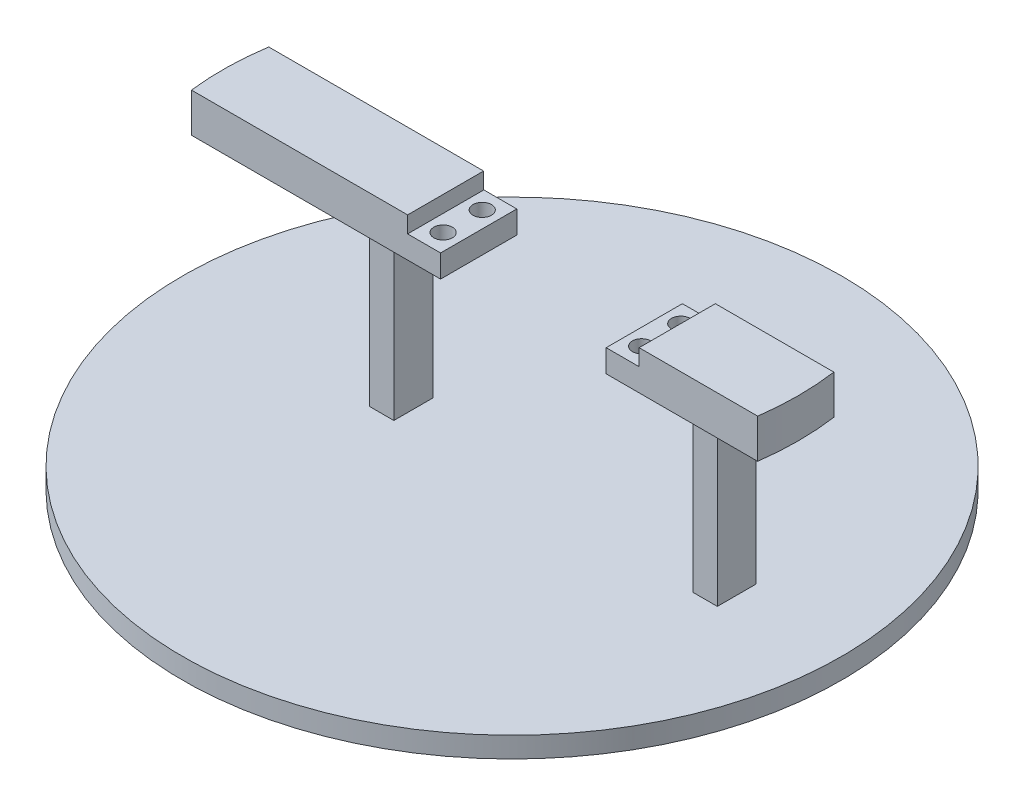
ISO-10303-21;
HEADER;
FILE_DESCRIPTION(('STEP AP214'),'2;1');
FILE_NAME('part.step','',(''),(''),'','','');
FILE_SCHEMA(('AUTOMOTIVE_DESIGN { 1 0 10303 214 1 1 1 1 }'));
ENDSEC;
DATA;
#1=APPLICATION_CONTEXT('core data for automotive mechanical design processes');
#2=APPLICATION_PROTOCOL_DEFINITION('international standard','automotive_design',2000,#1);
#3=PRODUCT_CONTEXT('',#1,'mechanical');
#4=PRODUCT('Part','Part','',(#3));
#5=PRODUCT_RELATED_PRODUCT_CATEGORY('part','',(#4));
#6=PRODUCT_DEFINITION_FORMATION('','',#4);
#7=PRODUCT_DEFINITION_CONTEXT('part definition',#1,'design');
#8=PRODUCT_DEFINITION('design','',#6,#7);
#9=PRODUCT_DEFINITION_SHAPE('','',#8);
#10=(LENGTH_UNIT() NAMED_UNIT(*) SI_UNIT(.MILLI.,.METRE.));
#11=(NAMED_UNIT(*) PLANE_ANGLE_UNIT() SI_UNIT($,.RADIAN.));
#12=(NAMED_UNIT(*) SI_UNIT($,.STERADIAN.) SOLID_ANGLE_UNIT());
#13=UNCERTAINTY_MEASURE_WITH_UNIT(LENGTH_MEASURE(1.E-05),#10,'distance_accuracy_value','');
#14=(GEOMETRIC_REPRESENTATION_CONTEXT(3) GLOBAL_UNCERTAINTY_ASSIGNED_CONTEXT((#13)) GLOBAL_UNIT_ASSIGNED_CONTEXT((#10,
#11,#12)) REPRESENTATION_CONTEXT('',''));
#15=CARTESIAN_POINT('',(0.,0.,0.));
#16=DIRECTION('',(0.,0.,1.));
#17=DIRECTION('',(1.,0.,0.));
#18=AXIS2_PLACEMENT_3D('',#15,#16,#17);
#19=CARTESIAN_POINT('',(-29.9126923195834,9.5,-4.65632595381181));
#20=DIRECTION('',(-1.,0.,0.));
#21=DIRECTION('',(0.,0.,1.));
#22=AXIS2_PLACEMENT_3D('',#19,#20,#21);
#23=PLANE('',#22);
#24=DIRECTION('',(0.,-1.,0.));
#25=VECTOR('',#24,1.);
#26=CARTESIAN_POINT('',(-29.9126923195834,9.5,-14.1563259538118));
#27=LINE('',#26,#25);
#28=CARTESIAN_POINT('',(-29.9126923195834,0.,-14.1563259538118));
#29=VERTEX_POINT('',#28);
#30=CARTESIAN_POINT('',(-29.9126923195834,-40.,-14.1563259538118));
#31=VERTEX_POINT('',#30);
#32=EDGE_CURVE('E287',#29,#31,#27,.T.);
#33=ORIENTED_EDGE('',*,*,#32,.T.);
#34=DIRECTION('',(0.,0.,1.));
#35=VECTOR('',#34,1.);
#36=CARTESIAN_POINT('',(-29.9126923195834,-40.,-4.65632595381181));
#37=LINE('',#36,#35);
#38=CARTESIAN_POINT('',(-29.9126923195834,-40.,-4.65632595381181));
#39=VERTEX_POINT('',#38);
#40=EDGE_CURVE('E58',#31,#39,#37,.T.);
#41=ORIENTED_EDGE('',*,*,#40,.T.);
#42=DIRECTION('',(0.,-1.,0.));
#43=VECTOR('',#42,1.);
#44=CARTESIAN_POINT('',(-29.9126923195834,9.5,-4.65632595381181));
#45=LINE('',#44,#43);
#46=CARTESIAN_POINT('',(-29.9126923195834,0.,-4.65632595381181));
#47=VERTEX_POINT('',#46);
#48=EDGE_CURVE('E288',#47,#39,#45,.T.);
#49=ORIENTED_EDGE('',*,*,#48,.F.);
#50=DIRECTION('',(0.,0.,-1.));
#51=VECTOR('',#50,1.);
#52=CARTESIAN_POINT('',(-29.9126923195834,0.,0.));
#53=LINE('',#52,#51);
#54=EDGE_CURVE('E316',#47,#29,#53,.T.);
#55=ORIENTED_EDGE('',*,*,#54,.T.);
#56=EDGE_LOOP('',(#33,#41,#49,#55));
#57=FACE_BOUND('',#56,.T.);
#58=ADVANCED_FACE('F35',(#57),#23,.T.);
#59=CARTESIAN_POINT('',(-29.9126923195834,9.5,-4.65632595381181));
#60=DIRECTION('',(0.,0.,-1.));
#61=DIRECTION('',(-1.,0.,0.));
#62=AXIS2_PLACEMENT_3D('',#59,#60,#61);
#63=PLANE('',#62);
#64=DIRECTION('',(-1.,0.,0.));
#65=VECTOR('',#64,1.);
#66=CARTESIAN_POINT('',(-29.9126923195834,-40.,-4.65632595381181));
#67=LINE('',#66,#65);
#68=CARTESIAN_POINT('',(-23.9626923195834,-40.,-4.65632595381181));
#69=VERTEX_POINT('',#68);
#70=EDGE_CURVE('E284',#69,#39,#67,.T.);
#71=ORIENTED_EDGE('',*,*,#70,.F.);
#72=DIRECTION('',(0.,-1.,0.));
#73=VECTOR('',#72,1.);
#74=CARTESIAN_POINT('',(-23.9626923195834,9.5,-4.65632595381181));
#75=LINE('',#74,#73);
#76=CARTESIAN_POINT('',(-23.9626923195834,0.,-4.65632595381181));
#77=VERTEX_POINT('',#76);
#78=EDGE_CURVE('E292',#77,#69,#75,.T.);
#79=ORIENTED_EDGE('',*,*,#78,.F.);
#80=DIRECTION('',(1.,0.,0.));
#81=VECTOR('',#80,1.);
#82=CARTESIAN_POINT('',(0.,0.,-4.65632595381181));
#83=LINE('',#82,#81);
#84=EDGE_CURVE('E314',#47,#77,#83,.T.);
#85=ORIENTED_EDGE('',*,*,#84,.F.);
#86=ORIENTED_EDGE('',*,*,#48,.T.);
#87=EDGE_LOOP('',(#71,#79,#85,#86));
#88=FACE_BOUND('',#87,.T.);
#89=ADVANCED_FACE('F426',(#88),#63,.F.);
#90=CARTESIAN_POINT('',(-23.9626923195834,9.5,-4.65632595381181));
#91=DIRECTION('',(-1.,0.,0.));
#92=DIRECTION('',(0.,0.,1.));
#93=AXIS2_PLACEMENT_3D('',#90,#91,#92);
#94=PLANE('',#93);
#95=DIRECTION('',(0.,0.,1.));
#96=VECTOR('',#95,1.);
#97=CARTESIAN_POINT('',(-23.9626923195834,-40.,-4.65632595381181));
#98=LINE('',#97,#96);
#99=CARTESIAN_POINT('',(-23.9626923195834,-40.,-14.1563259538118));
#100=VERTEX_POINT('',#99);
#101=EDGE_CURVE('E280',#100,#69,#98,.T.);
#102=ORIENTED_EDGE('',*,*,#101,.F.);
#103=DIRECTION('',(0.,-1.,0.));
#104=VECTOR('',#103,1.);
#105=CARTESIAN_POINT('',(-23.9626923195834,9.5,-14.1563259538118));
#106=LINE('',#105,#104);
#107=CARTESIAN_POINT('',(-23.9626923195834,0.,-14.1563259538118));
#108=VERTEX_POINT('',#107);
#109=EDGE_CURVE('E295',#108,#100,#106,.T.);
#110=ORIENTED_EDGE('',*,*,#109,.F.);
#111=DIRECTION('',(0.,0.,-1.));
#112=VECTOR('',#111,1.);
#113=CARTESIAN_POINT('',(-23.9626923195834,0.,0.));
#114=LINE('',#113,#112);
#115=EDGE_CURVE('E291',#77,#108,#114,.T.);
#116=ORIENTED_EDGE('',*,*,#115,.F.);
#117=ORIENTED_EDGE('',*,*,#78,.T.);
#118=EDGE_LOOP('',(#102,#110,#116,#117));
#119=FACE_BOUND('',#118,.T.);
#120=ADVANCED_FACE('F421',(#119),#94,.F.);
#121=CARTESIAN_POINT('',(-29.9126923195834,9.5,-14.1563259538118));
#122=DIRECTION('',(0.,0.,-1.));
#123=DIRECTION('',(-1.,0.,0.));
#124=AXIS2_PLACEMENT_3D('',#121,#122,#123);
#125=PLANE('',#124);
#126=ORIENTED_EDGE('',*,*,#109,.T.);
#127=DIRECTION('',(-1.,0.,0.));
#128=VECTOR('',#127,1.);
#129=CARTESIAN_POINT('',(-29.9126923195834,-40.,-14.1563259538118));
#130=LINE('',#129,#128);
#131=EDGE_CURVE('E11',#100,#31,#130,.T.);
#132=ORIENTED_EDGE('',*,*,#131,.T.);
#133=ORIENTED_EDGE('',*,*,#32,.F.);
#134=DIRECTION('',(1.,0.,0.));
#135=VECTOR('',#134,1.);
#136=CARTESIAN_POINT('',(0.,0.,-14.1563259538118));
#137=LINE('',#136,#135);
#138=EDGE_CURVE('E319',#29,#108,#137,.T.);
#139=ORIENTED_EDGE('',*,*,#138,.T.);
#140=EDGE_LOOP('',(#126,#132,#133,#139));
#141=FACE_BOUND('',#140,.T.);
#142=ADVANCED_FACE('F415',(#141),#125,.T.);
#143=CARTESIAN_POINT('',(-16.0156772185343,5.5,0.));
#144=DIRECTION('',(1.,0.,0.));
#145=DIRECTION('',(0.,0.,-1.));
#146=AXIS2_PLACEMENT_3D('',#143,#144,#145);
#147=PLANE('',#146);
#148=DIRECTION('',(0.,-1.,0.));
#149=VECTOR('',#148,1.);
#150=CARTESIAN_POINT('',(-16.0156772185343,9.5,-18.5));
#151=LINE('',#150,#149);
#152=CARTESIAN_POINT('',(-16.0156772185343,5.5,-18.5));
#153=VERTEX_POINT('',#152);
#154=CARTESIAN_POINT('',(-16.0156772185343,0.,-18.5));
#155=VERTEX_POINT('',#154);
#156=EDGE_CURVE('E43',#153,#155,#151,.T.);
#157=ORIENTED_EDGE('',*,*,#156,.F.);
#158=DIRECTION('',(0.,0.,1.));
#159=VECTOR('',#158,1.);
#160=CARTESIAN_POINT('',(-16.0156772185343,5.5,0.));
#161=LINE('',#160,#159);
#162=CARTESIAN_POINT('',(-16.0156772185343,5.5,-18.5547471156606));
#163=VERTEX_POINT('',#162);
#164=EDGE_CURVE('E346',#163,#153,#161,.T.);
#165=ORIENTED_EDGE('',*,*,#164,.F.);
#166=DIRECTION('',(0.,-1.,0.));
#167=VECTOR('',#166,1.);
#168=CARTESIAN_POINT('',(-16.0156772185343,5.5,-18.5547471156606));
#169=LINE('',#168,#167);
#170=CARTESIAN_POINT('',(-16.0156772185343,0.,-18.5547471156606));
#171=VERTEX_POINT('',#170);
#172=EDGE_CURVE('E374',#163,#171,#169,.T.);
#173=ORIENTED_EDGE('',*,*,#172,.T.);
#174=DIRECTION('',(0.,0.,1.));
#175=VECTOR('',#174,1.);
#176=CARTESIAN_POINT('',(-16.0156772185343,0.,0.));
#177=LINE('',#176,#175);
#178=EDGE_CURVE('E363',#171,#155,#177,.T.);
#179=ORIENTED_EDGE('',*,*,#178,.T.);
#180=EDGE_LOOP('',(#157,#165,#173,#179));
#181=FACE_BOUND('',#180,.T.);
#182=ADVANCED_FACE('F413',(#181),#147,.F.);
#183=CARTESIAN_POINT('',(-8.01567721853434,5.5,0.));
#184=DIRECTION('',(1.,0.,0.));
#185=DIRECTION('',(0.,0.,-1.));
#186=AXIS2_PLACEMENT_3D('',#183,#184,#185);
#187=PLANE('',#186);
#188=DIRECTION('',(0.,0.,1.));
#189=VECTOR('',#188,1.);
#190=CARTESIAN_POINT('',(-8.01567721853434,0.,0.));
#191=LINE('',#190,#189);
#192=CARTESIAN_POINT('',(-8.01567721853434,0.,-18.5547471156606));
#193=VERTEX_POINT('',#192);
#194=CARTESIAN_POINT('',(-8.01567721853434,0.,-0.0547471156605653));
#195=VERTEX_POINT('',#194);
#196=EDGE_CURVE('E337',#193,#195,#191,.T.);
#197=ORIENTED_EDGE('',*,*,#196,.F.);
#198=DIRECTION('',(0.,-1.,0.));
#199=VECTOR('',#198,1.);
#200=CARTESIAN_POINT('',(-8.01567721853434,5.5,-18.5547471156606));
#201=LINE('',#200,#199);
#202=CARTESIAN_POINT('',(-8.01567721853434,5.5,-18.5547471156606));
#203=VERTEX_POINT('',#202);
#204=EDGE_CURVE('E375',#203,#193,#201,.T.);
#205=ORIENTED_EDGE('',*,*,#204,.F.);
#206=DIRECTION('',(0.,0.,1.));
#207=VECTOR('',#206,1.);
#208=CARTESIAN_POINT('',(-8.01567721853434,5.5,0.));
#209=LINE('',#208,#207);
#210=CARTESIAN_POINT('',(-8.01567721853434,5.5,-0.0547471156605653));
#211=VERTEX_POINT('',#210);
#212=EDGE_CURVE('E338',#203,#211,#209,.T.);
#213=ORIENTED_EDGE('',*,*,#212,.T.);
#214=DIRECTION('',(0.,-1.,0.));
#215=VECTOR('',#214,1.);
#216=CARTESIAN_POINT('',(-8.01567721853434,5.5,-0.0547471156605653));
#217=LINE('',#216,#215);
#218=EDGE_CURVE('E357',#211,#195,#217,.T.);
#219=ORIENTED_EDGE('',*,*,#218,.T.);
#220=EDGE_LOOP('',(#197,#205,#213,#219));
#221=FACE_BOUND('',#220,.T.);
#222=ADVANCED_FACE('F37',(#221),#187,.T.);
#223=CARTESIAN_POINT('',(0.,5.5,-18.5547471156606));
#224=DIRECTION('',(0.,0.,-1.));
#225=DIRECTION('',(-1.,0.,0.));
#226=AXIS2_PLACEMENT_3D('',#223,#224,#225);
#227=PLANE('',#226);
#228=DIRECTION('',(1.,0.,0.));
#229=VECTOR('',#228,1.);
#230=CARTESIAN_POINT('',(0.,0.,-18.5547471156606));
#231=LINE('',#230,#229);
#232=EDGE_CURVE('E360',#171,#193,#231,.T.);
#233=ORIENTED_EDGE('',*,*,#232,.F.);
#234=ORIENTED_EDGE('',*,*,#172,.F.);
#235=DIRECTION('',(1.,0.,0.));
#236=VECTOR('',#235,1.);
#237=CARTESIAN_POINT('',(0.,5.5,-18.5547471156606));
#238=LINE('',#237,#236);
#239=EDGE_CURVE('E341',#163,#203,#238,.T.);
#240=ORIENTED_EDGE('',*,*,#239,.T.);
#241=ORIENTED_EDGE('',*,*,#204,.T.);
#242=EDGE_LOOP('',(#233,#234,#240,#241));
#243=FACE_BOUND('',#242,.T.);
#244=ADVANCED_FACE('F412',(#243),#227,.T.);
#245=CARTESIAN_POINT('',(-12.0097074206325,5.5,-4.65632595381181));
#246=DIRECTION('',(0.,-1.,0.));
#247=DIRECTION('',(0.,0.,-1.));
#248=AXIS2_PLACEMENT_3D('',#245,#246,#247);
#249=CYLINDRICAL_SURFACE('',#248,2.25);
#250=CARTESIAN_POINT('',(-12.0097074206325,5.5,-4.65632595381181));
#251=DIRECTION('',(0.,1.,0.));
#252=DIRECTION('',(0.,0.,1.));
#253=AXIS2_PLACEMENT_3D('',#250,#251,#252);
#254=CIRCLE('',#253,2.25);
#255=CARTESIAN_POINT('',(-12.0097074206325,5.5,-2.40632595381181));
#256=VERTEX_POINT('',#255);
#257=EDGE_CURVE('E351',#256,#256,#254,.T.);
#258=ORIENTED_EDGE('',*,*,#257,.T.);
#259=EDGE_LOOP('',(#258));
#260=FACE_BOUND('',#259,.T.);
#261=CARTESIAN_POINT('',(-12.0097074206325,0.,-4.65632595381181));
#262=DIRECTION('',(0.,1.,0.));
#263=DIRECTION('',(0.,0.,1.));
#264=AXIS2_PLACEMENT_3D('',#261,#262,#263);
#265=CIRCLE('',#264,2.25);
#266=CARTESIAN_POINT('',(-12.0097074206325,0.,-2.40632595381181));
#267=VERTEX_POINT('',#266);
#268=EDGE_CURVE('E368',#267,#267,#265,.T.);
#269=ORIENTED_EDGE('',*,*,#268,.F.);
#270=EDGE_LOOP('',(#269));
#271=FACE_BOUND('',#270,.T.);
#272=ADVANCED_FACE('F453',(#260,#271),#249,.F.);
#273=CARTESIAN_POINT('',(0.,5.5,-0.0547471156605653));
#274=DIRECTION('',(0.,0.,-1.));
#275=DIRECTION('',(-1.,0.,0.));
#276=AXIS2_PLACEMENT_3D('',#273,#274,#275);
#277=PLANE('',#276);
#278=DIRECTION('',(1.,0.,0.));
#279=VECTOR('',#278,1.);
#280=CARTESIAN_POINT('',(0.,0.,-0.0547471156605653));
#281=LINE('',#280,#279);
#282=CARTESIAN_POINT('',(-68.4860401881046,0.,-0.0547471156605653));
#283=VERTEX_POINT('',#282);
#284=EDGE_CURVE('E365',#283,#195,#281,.T.);
#285=ORIENTED_EDGE('',*,*,#284,.T.);
#286=ORIENTED_EDGE('',*,*,#218,.F.);
#287=DIRECTION('',(1.,0.,0.));
#288=VECTOR('',#287,1.);
#289=CARTESIAN_POINT('',(0.,5.5,-0.0547471156605653));
#290=LINE('',#289,#288);
#291=CARTESIAN_POINT('',(-16.0156772185343,5.5,-0.0547471156605653));
#292=VERTEX_POINT('',#291);
#293=EDGE_CURVE('E349',#292,#211,#290,.T.);
#294=ORIENTED_EDGE('',*,*,#293,.F.);
#295=DIRECTION('',(0.,-1.,0.));
#296=VECTOR('',#295,1.);
#297=CARTESIAN_POINT('',(-16.0156772185343,9.5,-0.0547471156605653));
#298=LINE('',#297,#296);
#299=CARTESIAN_POINT('',(-16.0156772185343,9.5,-0.0547471156605653));
#300=VERTEX_POINT('',#299);
#301=EDGE_CURVE('E329',#300,#292,#298,.T.);
#302=ORIENTED_EDGE('',*,*,#301,.F.);
#303=DIRECTION('',(1.,0.,0.));
#304=VECTOR('',#303,1.);
#305=CARTESIAN_POINT('',(0.,9.5,-0.0547471156605653));
#306=LINE('',#305,#304);
#307=CARTESIAN_POINT('',(-68.4860401881046,9.5,-0.0547471156605653));
#308=VERTEX_POINT('',#307);
#309=EDGE_CURVE('E307',#308,#300,#306,.T.);
#310=ORIENTED_EDGE('',*,*,#309,.F.);
#311=DIRECTION('',(0.,-1.,0.));
#312=VECTOR('',#311,1.);
#313=CARTESIAN_POINT('',(-68.4860401881046,9.5,-0.0547471156605653));
#314=LINE('',#313,#312);
#315=EDGE_CURVE('E332',#308,#283,#314,.T.);
#316=ORIENTED_EDGE('',*,*,#315,.T.);
#317=EDGE_LOOP('',(#285,#286,#294,#302,#310,#316));
#318=FACE_BOUND('',#317,.T.);
#319=ADVANCED_FACE('F410',(#318),#277,.F.);
#320=CARTESIAN_POINT('',(-12.0097074206325,5.5,-14.1563259538118));
#321=DIRECTION('',(0.,-1.,0.));
#322=DIRECTION('',(0.,0.,-1.));
#323=AXIS2_PLACEMENT_3D('',#320,#321,#322);
#324=CYLINDRICAL_SURFACE('',#323,2.25);
#325=CARTESIAN_POINT('',(-12.0097074206325,5.5,-14.1563259538118));
#326=DIRECTION('',(0.,1.,0.));
#327=DIRECTION('',(0.,0.,1.));
#328=AXIS2_PLACEMENT_3D('',#325,#326,#327);
#329=CIRCLE('',#328,2.25);
#330=CARTESIAN_POINT('',(-12.0097074206325,5.5,-11.9063259538118));
#331=VERTEX_POINT('',#330);
#332=EDGE_CURVE('E354',#331,#331,#329,.F.);
#333=ORIENTED_EDGE('',*,*,#332,.F.);
#334=EDGE_LOOP('',(#333));
#335=FACE_BOUND('',#334,.T.);
#336=CARTESIAN_POINT('',(-12.0097074206325,0.,-14.1563259538118));
#337=DIRECTION('',(0.,1.,0.));
#338=DIRECTION('',(0.,0.,1.));
#339=AXIS2_PLACEMENT_3D('',#336,#337,#338);
#340=CIRCLE('',#339,2.25);
#341=CARTESIAN_POINT('',(-12.0097074206325,0.,-11.9063259538118));
#342=VERTEX_POINT('',#341);
#343=EDGE_CURVE('E342',#342,#342,#340,.F.);
#344=ORIENTED_EDGE('',*,*,#343,.T.);
#345=EDGE_LOOP('',(#344));
#346=FACE_BOUND('',#345,.T.);
#347=ADVANCED_FACE('F447',(#335,#346),#324,.F.);
#348=CARTESIAN_POINT('',(0.,5.5,0.));
#349=DIRECTION('',(0.,1.,0.));
#350=DIRECTION('',(0.,0.,1.));
#351=AXIS2_PLACEMENT_3D('',#348,#349,#350);
#352=PLANE('',#351);
#353=ORIENTED_EDGE('',*,*,#212,.F.);
#354=ORIENTED_EDGE('',*,*,#239,.F.);
#355=ORIENTED_EDGE('',*,*,#164,.T.);
#356=EDGE_CURVE('E345',#153,#292,#161,.T.);
#357=ORIENTED_EDGE('',*,*,#356,.T.);
#358=ORIENTED_EDGE('',*,*,#293,.T.);
#359=EDGE_LOOP('',(#353,#354,#355,#357,#358));
#360=FACE_BOUND('',#359,.T.);
#361=ORIENTED_EDGE('',*,*,#257,.F.);
#362=EDGE_LOOP('',(#361));
#363=FACE_BOUND('',#362,.T.);
#364=ORIENTED_EDGE('',*,*,#332,.T.);
#365=EDGE_LOOP('',(#364));
#366=FACE_BOUND('',#365,.T.);
#367=ADVANCED_FACE('F405',(#360,#363,#366),#352,.T.);
#368=CARTESIAN_POINT('',(0.,0.,0.));
#369=DIRECTION('',(0.,1.,0.));
#370=DIRECTION('',(0.,0.,1.));
#371=AXIS2_PLACEMENT_3D('',#368,#369,#370);
#372=PLANE('',#371);
#373=ORIENTED_EDGE('',*,*,#196,.T.);
#374=ORIENTED_EDGE('',*,*,#284,.F.);
#375=CARTESIAN_POINT('',(-1.4695942603576,0.,-8.11985562164865));
#376=DIRECTION('',(0.,1.,0.));
#377=DIRECTION('',(0.,0.,1.));
#378=AXIS2_PLACEMENT_3D('',#375,#376,#377);
#379=CIRCLE('',#378,67.5);
#380=CARTESIAN_POINT('',(-68.1666901692844,0.,-18.5));
#381=VERTEX_POINT('',#380);
#382=EDGE_CURVE('E304',#381,#283,#379,.T.);
#383=ORIENTED_EDGE('',*,*,#382,.F.);
#384=DIRECTION('',(1.,0.,0.));
#385=VECTOR('',#384,1.);
#386=CARTESIAN_POINT('',(0.,0.,-18.5));
#387=LINE('',#386,#385);
#388=EDGE_CURVE('E322',#381,#155,#387,.T.);
#389=ORIENTED_EDGE('',*,*,#388,.T.);
#390=ORIENTED_EDGE('',*,*,#178,.F.);
#391=ORIENTED_EDGE('',*,*,#232,.T.);
#392=EDGE_LOOP('',(#373,#374,#383,#389,#390,#391));
#393=FACE_BOUND('',#392,.T.);
#394=ORIENTED_EDGE('',*,*,#268,.T.);
#395=EDGE_LOOP('',(#394));
#396=FACE_BOUND('',#395,.T.);
#397=ORIENTED_EDGE('',*,*,#343,.F.);
#398=EDGE_LOOP('',(#397));
#399=FACE_BOUND('',#398,.T.);
#400=ORIENTED_EDGE('',*,*,#115,.T.);
#401=ORIENTED_EDGE('',*,*,#138,.F.);
#402=ORIENTED_EDGE('',*,*,#54,.F.);
#403=ORIENTED_EDGE('',*,*,#84,.T.);
#404=EDGE_LOOP('',(#400,#401,#402,#403));
#405=FACE_BOUND('',#404,.T.);
#406=ADVANCED_FACE('F388',(#393,#396,#399,#405),#372,.F.);
#407=CARTESIAN_POINT('',(-16.0156772185343,9.5,0.));
#408=DIRECTION('',(1.,0.,0.));
#409=DIRECTION('',(0.,0.,-1.));
#410=AXIS2_PLACEMENT_3D('',#407,#408,#409);
#411=PLANE('',#410);
#412=ORIENTED_EDGE('',*,*,#356,.F.);
#413=CARTESIAN_POINT('',(-16.0156772185343,9.5,-18.5));
#414=VERTEX_POINT('',#413);
#415=EDGE_CURVE('E312',#414,#153,#151,.T.);
#416=ORIENTED_EDGE('',*,*,#415,.F.);
#417=DIRECTION('',(0.,0.,1.));
#418=VECTOR('',#417,1.);
#419=CARTESIAN_POINT('',(-16.0156772185343,9.5,0.));
#420=LINE('',#419,#418);
#421=EDGE_CURVE('E309',#414,#300,#420,.T.);
#422=ORIENTED_EDGE('',*,*,#421,.T.);
#423=ORIENTED_EDGE('',*,*,#301,.T.);
#424=EDGE_LOOP('',(#412,#416,#422,#423));
#425=FACE_BOUND('',#424,.T.);
#426=ADVANCED_FACE('F401',(#425),#411,.T.);
#427=CARTESIAN_POINT('',(0.,9.5,-18.5));
#428=DIRECTION('',(0.,0.,-1.));
#429=DIRECTION('',(-1.,0.,0.));
#430=AXIS2_PLACEMENT_3D('',#427,#428,#429);
#431=PLANE('',#430);
#432=ORIENTED_EDGE('',*,*,#388,.F.);
#433=DIRECTION('',(0.,-1.,0.));
#434=VECTOR('',#433,1.);
#435=CARTESIAN_POINT('',(-68.1666901692844,9.5,-18.5));
#436=LINE('',#435,#434);
#437=CARTESIAN_POINT('',(-68.1666901692844,9.5,-18.5));
#438=VERTEX_POINT('',#437);
#439=EDGE_CURVE('E335',#438,#381,#436,.T.);
#440=ORIENTED_EDGE('',*,*,#439,.F.);
#441=DIRECTION('',(1.,0.,0.));
#442=VECTOR('',#441,1.);
#443=CARTESIAN_POINT('',(0.,9.5,-18.5));
#444=LINE('',#443,#442);
#445=EDGE_CURVE('E300',#438,#414,#444,.T.);
#446=ORIENTED_EDGE('',*,*,#445,.T.);
#447=ORIENTED_EDGE('',*,*,#415,.T.);
#448=ORIENTED_EDGE('',*,*,#156,.T.);
#449=EDGE_LOOP('',(#432,#440,#446,#447,#448));
#450=FACE_BOUND('',#449,.T.);
#451=ADVANCED_FACE('F382',(#450),#431,.T.);
#452=CARTESIAN_POINT('',(-1.4695942603576,9.5,-8.11985562164865));
#453=DIRECTION('',(0.,-1.,0.));
#454=DIRECTION('',(0.,0.,-1.));
#455=AXIS2_PLACEMENT_3D('',#452,#453,#454);
#456=CYLINDRICAL_SURFACE('',#455,67.5);
#457=ORIENTED_EDGE('',*,*,#382,.T.);
#458=ORIENTED_EDGE('',*,*,#315,.F.);
#459=CARTESIAN_POINT('',(-1.4695942603576,9.5,-8.11985562164865));
#460=DIRECTION('',(0.,1.,0.));
#461=DIRECTION('',(0.,0.,1.));
#462=AXIS2_PLACEMENT_3D('',#459,#460,#461);
#463=CIRCLE('',#462,67.5);
#464=EDGE_CURVE('E303',#438,#308,#463,.T.);
#465=ORIENTED_EDGE('',*,*,#464,.F.);
#466=ORIENTED_EDGE('',*,*,#439,.T.);
#467=EDGE_LOOP('',(#457,#458,#465,#466));
#468=FACE_BOUND('',#467,.T.);
#469=ADVANCED_FACE('F392',(#468),#456,.T.);
#470=CARTESIAN_POINT('',(0.,9.5,0.));
#471=DIRECTION('',(0.,1.,0.));
#472=DIRECTION('',(0.,0.,1.));
#473=AXIS2_PLACEMENT_3D('',#470,#471,#472);
#474=PLANE('',#473);
#475=ORIENTED_EDGE('',*,*,#445,.F.);
#476=ORIENTED_EDGE('',*,*,#464,.T.);
#477=ORIENTED_EDGE('',*,*,#309,.T.);
#478=ORIENTED_EDGE('',*,*,#421,.F.);
#479=EDGE_LOOP('',(#475,#476,#477,#478));
#480=FACE_BOUND('',#479,.T.);
#481=ADVANCED_FACE('F397',(#480),#474,.T.);
#482=CARTESIAN_POINT('',(-0.015677218534336,-40.,-9.4063259538118));
#483=DIRECTION('',(0.,-1.,0.));
#484=DIRECTION('',(0.,0.,-1.));
#485=AXIS2_PLACEMENT_3D('',#482,#483,#484);
#486=CYLINDRICAL_SURFACE('',#485,80.);
#487=CARTESIAN_POINT('',(-0.015677218534336,-40.,-9.4063259538118));
#488=DIRECTION('',(0.,-1.,0.));
#489=DIRECTION('',(0.,0.,-1.));
#490=AXIS2_PLACEMENT_3D('',#487,#488,#489);
#491=CIRCLE('',#490,80.);
#492=CARTESIAN_POINT('',(-0.015677218534336,-40.,-89.4063259538118));
#493=VERTEX_POINT('',#492);
#494=EDGE_CURVE('E277',#493,#493,#491,.T.);
#495=ORIENTED_EDGE('',*,*,#494,.T.);
#496=EDGE_LOOP('',(#495));
#497=FACE_BOUND('',#496,.T.);
#498=CARTESIAN_POINT('',(-0.015677218534336,-45.,-9.4063259538118));
#499=DIRECTION('',(0.,-1.,0.));
#500=DIRECTION('',(0.,0.,-1.));
#501=AXIS2_PLACEMENT_3D('',#498,#499,#500);
#502=CIRCLE('',#501,80.);
#503=CARTESIAN_POINT('',(-0.015677218534336,-45.,-89.4063259538118));
#504=VERTEX_POINT('',#503);
#505=EDGE_CURVE('E276',#504,#504,#502,.T.);
#506=ORIENTED_EDGE('',*,*,#505,.F.);
#507=EDGE_LOOP('',(#506));
#508=FACE_BOUND('',#507,.T.);
#509=ADVANCED_FACE('F438',(#497,#508),#486,.T.);
#510=CARTESIAN_POINT('',(-0.015677218534336,-40.,-9.4063259538118));
#511=DIRECTION('',(0.,-1.,0.));
#512=DIRECTION('',(0.,0.,-1.));
#513=AXIS2_PLACEMENT_3D('',#510,#511,#512);
#514=PLANE('',#513);
#515=DIRECTION('',(1.,0.,0.));
#516=VECTOR('',#515,1.);
#517=CARTESIAN_POINT('',(-0.015677218534336,-40.,-4.83776791817675));
#518=LINE('',#517,#516);
#519=CARTESIAN_POINT('',(48.4370382464637,-40.,-4.83776791817675));
#520=VERTEX_POINT('',#519);
#521=CARTESIAN_POINT('',(54.3835275887317,-40.,-4.83776791817675));
#522=VERTEX_POINT('',#521);
#523=EDGE_CURVE('E271',#520,#522,#518,.T.);
#524=ORIENTED_EDGE('',*,*,#523,.F.);
#525=DIRECTION('',(0.,0.,-1.));
#526=VECTOR('',#525,1.);
#527=CARTESIAN_POINT('',(48.4370382464637,-40.,-9.4063259538118));
#528=LINE('',#527,#526);
#529=CARTESIAN_POINT('',(48.4370382464637,-40.,-14.1619784991011));
#530=VERTEX_POINT('',#529);
#531=EDGE_CURVE('E273',#520,#530,#528,.T.);
#532=ORIENTED_EDGE('',*,*,#531,.T.);
#533=DIRECTION('',(1.,0.,0.));
#534=VECTOR('',#533,1.);
#535=CARTESIAN_POINT('',(-0.015677218534336,-40.,-14.1619784991011));
#536=LINE('',#535,#534);
#537=CARTESIAN_POINT('',(54.3835275887317,-40.,-14.1619784991011));
#538=VERTEX_POINT('',#537);
#539=EDGE_CURVE('E268',#530,#538,#536,.T.);
#540=ORIENTED_EDGE('',*,*,#539,.T.);
#541=DIRECTION('',(0.,0.,-1.));
#542=VECTOR('',#541,1.);
#543=CARTESIAN_POINT('',(54.3835275887317,-40.,-9.4063259538118));
#544=LINE('',#543,#542);
#545=EDGE_CURVE('E199',#522,#538,#544,.T.);
#546=ORIENTED_EDGE('',*,*,#545,.F.);
#547=EDGE_LOOP('',(#524,#532,#540,#546));
#548=FACE_BOUND('',#547,.T.);
#549=ORIENTED_EDGE('',*,*,#40,.F.);
#550=ORIENTED_EDGE('',*,*,#131,.F.);
#551=ORIENTED_EDGE('',*,*,#101,.T.);
#552=ORIENTED_EDGE('',*,*,#70,.T.);
#553=EDGE_LOOP('',(#549,#550,#551,#552));
#554=FACE_BOUND('',#553,.T.);
#555=ORIENTED_EDGE('',*,*,#494,.F.);
#556=EDGE_LOOP('',(#555));
#557=FACE_BOUND('',#556,.T.);
#558=ADVANCED_FACE('F496',(#548,#554,#557),#514,.F.);
#559=CARTESIAN_POINT('',(0.,-45.,0.));
#560=DIRECTION('',(0.,-1.,0.));
#561=DIRECTION('',(0.,0.,-1.));
#562=AXIS2_PLACEMENT_3D('',#559,#560,#561);
#563=PLANE('',#562);
#564=ORIENTED_EDGE('',*,*,#505,.T.);
#565=EDGE_LOOP('',(#564));
#566=FACE_BOUND('',#565,.T.);
#567=ADVANCED_FACE('F505',(#566),#563,.T.);
#568=CARTESIAN_POINT('',(48.4370382464637,9.5,-4.83776791817675));
#569=DIRECTION('',(-1.,0.,0.));
#570=DIRECTION('',(0.,0.,1.));
#571=AXIS2_PLACEMENT_3D('',#568,#569,#570);
#572=PLANE('',#571);
#573=ORIENTED_EDGE('',*,*,#531,.F.);
#574=DIRECTION('',(0.,-1.,0.));
#575=VECTOR('',#574,1.);
#576=CARTESIAN_POINT('',(48.4370382464637,9.5,-4.83776791817675));
#577=LINE('',#576,#575);
#578=CARTESIAN_POINT('',(48.4370382464637,0.,-4.83776791817675));
#579=VERTEX_POINT('',#578);
#580=EDGE_CURVE('E204',#579,#520,#577,.T.);
#581=ORIENTED_EDGE('',*,*,#580,.F.);
#582=DIRECTION('',(0.,0.,-1.));
#583=VECTOR('',#582,1.);
#584=CARTESIAN_POINT('',(48.4370382464637,0.,0.));
#585=LINE('',#584,#583);
#586=CARTESIAN_POINT('',(48.4370382464637,0.,-14.1619784991011));
#587=VERTEX_POINT('',#586);
#588=EDGE_CURVE('E195',#579,#587,#585,.T.);
#589=ORIENTED_EDGE('',*,*,#588,.T.);
#590=DIRECTION('',(0.,-1.,0.));
#591=VECTOR('',#590,1.);
#592=CARTESIAN_POINT('',(48.4370382464637,9.5,-14.1619784991011));
#593=LINE('',#592,#591);
#594=EDGE_CURVE('E189',#587,#530,#593,.T.);
#595=ORIENTED_EDGE('',*,*,#594,.T.);
#596=EDGE_LOOP('',(#573,#581,#589,#595));
#597=FACE_BOUND('',#596,.T.);
#598=ADVANCED_FACE('F513',(#597),#572,.T.);
#599=CARTESIAN_POINT('',(48.4370382464637,9.5,-4.83776791817675));
#600=DIRECTION('',(0.,0.,-1.));
#601=DIRECTION('',(-1.,0.,0.));
#602=AXIS2_PLACEMENT_3D('',#599,#600,#601);
#603=PLANE('',#602);
#604=ORIENTED_EDGE('',*,*,#580,.T.);
#605=ORIENTED_EDGE('',*,*,#523,.T.);
#606=DIRECTION('',(0.,-1.,0.));
#607=VECTOR('',#606,1.);
#608=CARTESIAN_POINT('',(54.3835275887317,9.5,-4.83776791817675));
#609=LINE('',#608,#607);
#610=CARTESIAN_POINT('',(54.3835275887317,0.,-4.83776791817675));
#611=VERTEX_POINT('',#610);
#612=EDGE_CURVE('E201',#611,#522,#609,.T.);
#613=ORIENTED_EDGE('',*,*,#612,.F.);
#614=DIRECTION('',(1.,0.,0.));
#615=VECTOR('',#614,1.);
#616=CARTESIAN_POINT('',(0.,0.,-4.83776791817675));
#617=LINE('',#616,#615);
#618=EDGE_CURVE('E185',#579,#611,#617,.T.);
#619=ORIENTED_EDGE('',*,*,#618,.F.);
#620=EDGE_LOOP('',(#604,#605,#613,#619));
#621=FACE_BOUND('',#620,.T.);
#622=ADVANCED_FACE('F521',(#621),#603,.F.);
#623=CARTESIAN_POINT('',(54.3835275887317,9.5,-4.83776791817675));
#624=DIRECTION('',(-1.,0.,0.));
#625=DIRECTION('',(0.,0.,1.));
#626=AXIS2_PLACEMENT_3D('',#623,#624,#625);
#627=PLANE('',#626);
#628=ORIENTED_EDGE('',*,*,#612,.T.);
#629=ORIENTED_EDGE('',*,*,#545,.T.);
#630=DIRECTION('',(0.,-1.,0.));
#631=VECTOR('',#630,1.);
#632=CARTESIAN_POINT('',(54.3835275887317,9.5,-14.1619784991011));
#633=LINE('',#632,#631);
#634=CARTESIAN_POINT('',(54.3835275887317,0.,-14.1619784991011));
#635=VERTEX_POINT('',#634);
#636=EDGE_CURVE('E50',#635,#538,#633,.T.);
#637=ORIENTED_EDGE('',*,*,#636,.F.);
#638=DIRECTION('',(0.,0.,-1.));
#639=VECTOR('',#638,1.);
#640=CARTESIAN_POINT('',(54.3835275887317,0.,0.));
#641=LINE('',#640,#639);
#642=EDGE_CURVE('E180',#611,#635,#641,.T.);
#643=ORIENTED_EDGE('',*,*,#642,.F.);
#644=EDGE_LOOP('',(#628,#629,#637,#643));
#645=FACE_BOUND('',#644,.T.);
#646=ADVANCED_FACE('F197',(#645),#627,.F.);
#647=CARTESIAN_POINT('',(48.4370382464637,9.5,-14.1619784991011));
#648=DIRECTION('',(0.,0.,-1.));
#649=DIRECTION('',(-1.,0.,0.));
#650=AXIS2_PLACEMENT_3D('',#647,#648,#649);
#651=PLANE('',#650);
#652=ORIENTED_EDGE('',*,*,#539,.F.);
#653=ORIENTED_EDGE('',*,*,#594,.F.);
#654=DIRECTION('',(1.,0.,0.));
#655=VECTOR('',#654,1.);
#656=CARTESIAN_POINT('',(0.,0.,-14.1619784991011));
#657=LINE('',#656,#655);
#658=EDGE_CURVE('E182',#587,#635,#657,.T.);
#659=ORIENTED_EDGE('',*,*,#658,.T.);
#660=ORIENTED_EDGE('',*,*,#636,.T.);
#661=EDGE_LOOP('',(#652,#653,#659,#660));
#662=FACE_BOUND('',#661,.T.);
#663=ADVANCED_FACE('F192',(#662),#651,.T.);
#664=CARTESIAN_POINT('',(0.,5.5,-18.7361890800255));
#665=DIRECTION('',(0.,0.,-1.));
#666=DIRECTION('',(-1.,0.,0.));
#667=AXIS2_PLACEMENT_3D('',#664,#665,#666);
#668=PLANE('',#667);
#669=DIRECTION('',(1.,0.,0.));
#670=VECTOR('',#669,1.);
#671=CARTESIAN_POINT('',(0.,0.,-18.7361890800255));
#672=LINE('',#671,#670);
#673=CARTESIAN_POINT('',(31.998888008711,0.,-18.7361890800255));
#674=VERTEX_POINT('',#673);
#675=CARTESIAN_POINT('',(68.7681671687523,0.,-18.7361890800255));
#676=VERTEX_POINT('',#675);
#677=EDGE_CURVE('E235',#674,#676,#672,.T.);
#678=ORIENTED_EDGE('',*,*,#677,.F.);
#679=DIRECTION('',(0.,-1.,0.));
#680=VECTOR('',#679,1.);
#681=CARTESIAN_POINT('',(31.998888008711,5.5,-18.7361890800255));
#682=LINE('',#681,#680);
#683=CARTESIAN_POINT('',(31.998888008711,5.5,-18.7361890800255));
#684=VERTEX_POINT('',#683);
#685=EDGE_CURVE('E266',#684,#674,#682,.T.);
#686=ORIENTED_EDGE('',*,*,#685,.F.);
#687=DIRECTION('',(1.,0.,0.));
#688=VECTOR('',#687,1.);
#689=CARTESIAN_POINT('',(0.,5.5,-18.7361890800255));
#690=LINE('',#689,#688);
#691=CARTESIAN_POINT('',(39.998888008711,5.5,-18.7361890800255));
#692=VERTEX_POINT('',#691);
#693=EDGE_CURVE('E239',#684,#692,#690,.T.);
#694=ORIENTED_EDGE('',*,*,#693,.T.);
#695=DIRECTION('',(0.,-1.,0.));
#696=VECTOR('',#695,1.);
#697=CARTESIAN_POINT('',(39.998888008711,9.5,-18.7361890800255));
#698=LINE('',#697,#696);
#699=CARTESIAN_POINT('',(39.998888008711,9.5,-18.7361890800255));
#700=VERTEX_POINT('',#699);
#701=EDGE_CURVE('E226',#700,#692,#698,.T.);
#702=ORIENTED_EDGE('',*,*,#701,.F.);
#703=DIRECTION('',(1.,0.,0.));
#704=VECTOR('',#703,1.);
#705=CARTESIAN_POINT('',(0.,9.5,-18.7361890800255));
#706=LINE('',#705,#704);
#707=CARTESIAN_POINT('',(68.7681671687523,9.5,-18.7361890800255));
#708=VERTEX_POINT('',#707);
#709=EDGE_CURVE('E214',#700,#708,#706,.T.);
#710=ORIENTED_EDGE('',*,*,#709,.T.);
#711=DIRECTION('',(0.,-1.,0.));
#712=VECTOR('',#711,1.);
#713=CARTESIAN_POINT('',(68.7681671687523,9.5,-18.7361890800255));
#714=LINE('',#713,#712);
#715=EDGE_CURVE('E229',#708,#676,#714,.T.);
#716=ORIENTED_EDGE('',*,*,#715,.T.);
#717=EDGE_LOOP('',(#678,#686,#694,#702,#710,#716));
#718=FACE_BOUND('',#717,.T.);
#719=ADVANCED_FACE('F542',(#718),#668,.T.);
#720=CARTESIAN_POINT('',(31.998888008711,5.5,0.));
#721=DIRECTION('',(1.,0.,0.));
#722=DIRECTION('',(0.,0.,-1.));
#723=AXIS2_PLACEMENT_3D('',#720,#721,#722);
#724=PLANE('',#723);
#725=DIRECTION('',(0.,0.,1.));
#726=VECTOR('',#725,1.);
#727=CARTESIAN_POINT('',(31.998888008711,0.,0.));
#728=LINE('',#727,#726);
#729=CARTESIAN_POINT('',(31.998888008711,0.,-0.236189080025512));
#730=VERTEX_POINT('',#729);
#731=EDGE_CURVE('E255',#674,#730,#728,.T.);
#732=ORIENTED_EDGE('',*,*,#731,.T.);
#733=DIRECTION('',(0.,-1.,0.));
#734=VECTOR('',#733,1.);
#735=CARTESIAN_POINT('',(31.998888008711,5.5,-0.236189080025512));
#736=LINE('',#735,#734);
#737=CARTESIAN_POINT('',(31.998888008711,5.5,-0.236189080025512));
#738=VERTEX_POINT('',#737);
#739=EDGE_CURVE('E253',#738,#730,#736,.T.);
#740=ORIENTED_EDGE('',*,*,#739,.F.);
#741=DIRECTION('',(0.,0.,1.));
#742=VECTOR('',#741,1.);
#743=CARTESIAN_POINT('',(31.998888008711,5.5,0.));
#744=LINE('',#743,#742);
#745=EDGE_CURVE('E243',#684,#738,#744,.T.);
#746=ORIENTED_EDGE('',*,*,#745,.F.);
#747=ORIENTED_EDGE('',*,*,#685,.T.);
#748=EDGE_LOOP('',(#732,#740,#746,#747));
#749=FACE_BOUND('',#748,.T.);
#750=ADVANCED_FACE('F549',(#749),#724,.F.);
#751=CARTESIAN_POINT('',(36.0048578066128,5.5,-4.83776791817675));
#752=DIRECTION('',(0.,-1.,0.));
#753=DIRECTION('',(0.,0.,-1.));
#754=AXIS2_PLACEMENT_3D('',#751,#752,#753);
#755=CYLINDRICAL_SURFACE('',#754,2.25);
#756=CARTESIAN_POINT('',(36.0048578066128,5.5,-4.83776791817675));
#757=DIRECTION('',(0.,1.,0.));
#758=DIRECTION('',(0.,0.,1.));
#759=AXIS2_PLACEMENT_3D('',#756,#757,#758);
#760=CIRCLE('',#759,2.25);
#761=CARTESIAN_POINT('',(36.0048578066128,5.5,-2.58776791817676));
#762=VERTEX_POINT('',#761);
#763=EDGE_CURVE('E247',#762,#762,#760,.T.);
#764=ORIENTED_EDGE('',*,*,#763,.T.);
#765=EDGE_LOOP('',(#764));
#766=FACE_BOUND('',#765,.T.);
#767=CARTESIAN_POINT('',(36.0048578066128,0.,-4.83776791817675));
#768=DIRECTION('',(0.,1.,0.));
#769=DIRECTION('',(0.,0.,1.));
#770=AXIS2_PLACEMENT_3D('',#767,#768,#769);
#771=CIRCLE('',#770,2.25);
#772=CARTESIAN_POINT('',(36.0048578066128,0.,-2.58776791817676));
#773=VERTEX_POINT('',#772);
#774=EDGE_CURVE('E259',#773,#773,#771,.T.);
#775=ORIENTED_EDGE('',*,*,#774,.F.);
#776=EDGE_LOOP('',(#775));
#777=FACE_BOUND('',#776,.T.);
#778=ADVANCED_FACE('F557',(#766,#777),#755,.F.);
#779=CARTESIAN_POINT('',(0.,5.5,-0.236189080025512));
#780=DIRECTION('',(0.,0.,-1.));
#781=DIRECTION('',(-1.,0.,0.));
#782=AXIS2_PLACEMENT_3D('',#779,#780,#781);
#783=PLANE('',#782);
#784=DIRECTION('',(1.,0.,0.));
#785=VECTOR('',#784,1.);
#786=CARTESIAN_POINT('',(0.,0.,-0.236189080025512));
#787=LINE('',#786,#785);
#788=CARTESIAN_POINT('',(68.777433583756,0.,-0.236189080025512));
#789=VERTEX_POINT('',#788);
#790=EDGE_CURVE('E257',#730,#789,#787,.T.);
#791=ORIENTED_EDGE('',*,*,#790,.T.);
#792=DIRECTION('',(0.,-1.,0.));
#793=VECTOR('',#792,1.);
#794=CARTESIAN_POINT('',(68.777433583756,9.5,-0.236189080025512));
#795=LINE('',#794,#793);
#796=CARTESIAN_POINT('',(68.777433583756,9.5,-0.236189080025512));
#797=VERTEX_POINT('',#796);
#798=EDGE_CURVE('E232',#797,#789,#795,.T.);
#799=ORIENTED_EDGE('',*,*,#798,.F.);
#800=DIRECTION('',(1.,0.,0.));
#801=VECTOR('',#800,1.);
#802=CARTESIAN_POINT('',(0.,9.5,-0.236189080025512));
#803=LINE('',#802,#801);
#804=CARTESIAN_POINT('',(39.998888008711,9.5,-0.236189080025512));
#805=VERTEX_POINT('',#804);
#806=EDGE_CURVE('E209',#805,#797,#803,.T.);
#807=ORIENTED_EDGE('',*,*,#806,.F.);
#808=DIRECTION('',(0.,-1.,0.));
#809=VECTOR('',#808,1.);
#810=CARTESIAN_POINT('',(39.998888008711,9.5,-0.236189080025512));
#811=LINE('',#810,#809);
#812=CARTESIAN_POINT('',(39.998888008711,5.5,-0.236189080025512));
#813=VERTEX_POINT('',#812);
#814=EDGE_CURVE('E218',#805,#813,#811,.T.);
#815=ORIENTED_EDGE('',*,*,#814,.T.);
#816=DIRECTION('',(1.,0.,0.));
#817=VECTOR('',#816,1.);
#818=CARTESIAN_POINT('',(0.,5.5,-0.236189080025512));
#819=LINE('',#818,#817);
#820=EDGE_CURVE('E245',#738,#813,#819,.T.);
#821=ORIENTED_EDGE('',*,*,#820,.F.);
#822=ORIENTED_EDGE('',*,*,#739,.T.);
#823=EDGE_LOOP('',(#791,#799,#807,#815,#821,#822));
#824=FACE_BOUND('',#823,.T.);
#825=ADVANCED_FACE('F565',(#824),#783,.F.);
#826=CARTESIAN_POINT('',(36.0048578066128,5.5,-14.3377679181768));
#827=DIRECTION('',(0.,-1.,0.));
#828=DIRECTION('',(0.,0.,-1.));
#829=AXIS2_PLACEMENT_3D('',#826,#827,#828);
#830=CYLINDRICAL_SURFACE('',#829,2.25);
#831=CARTESIAN_POINT('',(36.0048578066128,5.5,-14.3377679181768));
#832=DIRECTION('',(0.,1.,0.));
#833=DIRECTION('',(0.,0.,1.));
#834=AXIS2_PLACEMENT_3D('',#831,#832,#833);
#835=CIRCLE('',#834,2.25);
#836=CARTESIAN_POINT('',(36.0048578066128,5.5,-12.0877679181768));
#837=VERTEX_POINT('',#836);
#838=EDGE_CURVE('E250',#837,#837,#835,.F.);
#839=ORIENTED_EDGE('',*,*,#838,.F.);
#840=EDGE_LOOP('',(#839));
#841=FACE_BOUND('',#840,.T.);
#842=CARTESIAN_POINT('',(36.0048578066128,0.,-14.3377679181768));
#843=DIRECTION('',(0.,1.,0.));
#844=DIRECTION('',(0.,0.,1.));
#845=AXIS2_PLACEMENT_3D('',#842,#843,#844);
#846=CIRCLE('',#845,2.25);
#847=CARTESIAN_POINT('',(36.0048578066128,0.,-12.0877679181768));
#848=VERTEX_POINT('',#847);
#849=EDGE_CURVE('E240',#848,#848,#846,.F.);
#850=ORIENTED_EDGE('',*,*,#849,.T.);
#851=EDGE_LOOP('',(#850));
#852=FACE_BOUND('',#851,.T.);
#853=ADVANCED_FACE('F573',(#841,#852),#830,.F.);
#854=CARTESIAN_POINT('',(0.,5.5,0.));
#855=DIRECTION('',(0.,1.,0.));
#856=DIRECTION('',(0.,0.,1.));
#857=AXIS2_PLACEMENT_3D('',#854,#855,#856);
#858=PLANE('',#857);
#859=DIRECTION('',(0.,0.,1.));
#860=VECTOR('',#859,1.);
#861=CARTESIAN_POINT('',(39.998888008711,5.5,0.));
#862=LINE('',#861,#860);
#863=EDGE_CURVE('E236',#692,#813,#862,.T.);
#864=ORIENTED_EDGE('',*,*,#863,.F.);
#865=ORIENTED_EDGE('',*,*,#693,.F.);
#866=ORIENTED_EDGE('',*,*,#745,.T.);
#867=ORIENTED_EDGE('',*,*,#820,.T.);
#868=EDGE_LOOP('',(#864,#865,#866,#867));
#869=FACE_BOUND('',#868,.T.);
#870=ORIENTED_EDGE('',*,*,#763,.F.);
#871=EDGE_LOOP('',(#870));
#872=FACE_BOUND('',#871,.T.);
#873=ORIENTED_EDGE('',*,*,#838,.T.);
#874=EDGE_LOOP('',(#873));
#875=FACE_BOUND('',#874,.T.);
#876=ADVANCED_FACE('F581',(#869,#872,#875),#858,.T.);
#877=CARTESIAN_POINT('',(0.,0.,0.));
#878=DIRECTION('',(0.,1.,0.));
#879=DIRECTION('',(0.,0.,1.));
#880=AXIS2_PLACEMENT_3D('',#877,#878,#879);
#881=PLANE('',#880);
#882=ORIENTED_EDGE('',*,*,#677,.T.);
#883=CARTESIAN_POINT('',(1.90960903085509,0.,-9.45269815681035));
#884=DIRECTION('',(0.,1.,0.));
#885=DIRECTION('',(0.,0.,1.));
#886=AXIS2_PLACEMENT_3D('',#883,#884,#885);
#887=CIRCLE('',#886,67.5);
#888=EDGE_CURVE('E194',#789,#676,#887,.T.);
#889=ORIENTED_EDGE('',*,*,#888,.F.);
#890=ORIENTED_EDGE('',*,*,#790,.F.);
#891=ORIENTED_EDGE('',*,*,#731,.F.);
#892=EDGE_LOOP('',(#882,#889,#890,#891));
#893=FACE_BOUND('',#892,.T.);
#894=ORIENTED_EDGE('',*,*,#774,.T.);
#895=EDGE_LOOP('',(#894));
#896=FACE_BOUND('',#895,.T.);
#897=ORIENTED_EDGE('',*,*,#849,.F.);
#898=EDGE_LOOP('',(#897));
#899=FACE_BOUND('',#898,.T.);
#900=ORIENTED_EDGE('',*,*,#642,.T.);
#901=ORIENTED_EDGE('',*,*,#658,.F.);
#902=ORIENTED_EDGE('',*,*,#588,.F.);
#903=ORIENTED_EDGE('',*,*,#618,.T.);
#904=EDGE_LOOP('',(#900,#901,#902,#903));
#905=FACE_BOUND('',#904,.T.);
#906=ADVANCED_FACE('F181',(#893,#896,#899,#905),#881,.F.);
#907=CARTESIAN_POINT('',(39.998888008711,9.5,0.));
#908=DIRECTION('',(1.,0.,0.));
#909=DIRECTION('',(0.,0.,-1.));
#910=AXIS2_PLACEMENT_3D('',#907,#908,#909);
#911=PLANE('',#910);
#912=ORIENTED_EDGE('',*,*,#701,.T.);
#913=ORIENTED_EDGE('',*,*,#863,.T.);
#914=ORIENTED_EDGE('',*,*,#814,.F.);
#915=DIRECTION('',(0.,0.,1.));
#916=VECTOR('',#915,1.);
#917=CARTESIAN_POINT('',(39.998888008711,9.5,0.));
#918=LINE('',#917,#916);
#919=EDGE_CURVE('E217',#700,#805,#918,.T.);
#920=ORIENTED_EDGE('',*,*,#919,.F.);
#921=EDGE_LOOP('',(#912,#913,#914,#920));
#922=FACE_BOUND('',#921,.T.);
#923=ADVANCED_FACE('F596',(#922),#911,.F.);
#924=CARTESIAN_POINT('',(1.90960903085509,9.5,-9.45269815681035));
#925=DIRECTION('',(0.,-1.,0.));
#926=DIRECTION('',(0.,0.,-1.));
#927=AXIS2_PLACEMENT_3D('',#924,#925,#926);
#928=CYLINDRICAL_SURFACE('',#927,67.5);
#929=ORIENTED_EDGE('',*,*,#888,.T.);
#930=ORIENTED_EDGE('',*,*,#715,.F.);
#931=CARTESIAN_POINT('',(1.90960903085509,9.5,-9.45269815681035));
#932=DIRECTION('',(0.,1.,0.));
#933=DIRECTION('',(0.,0.,1.));
#934=AXIS2_PLACEMENT_3D('',#931,#932,#933);
#935=CIRCLE('',#934,67.5);
#936=EDGE_CURVE('E212',#797,#708,#935,.T.);
#937=ORIENTED_EDGE('',*,*,#936,.F.);
#938=ORIENTED_EDGE('',*,*,#798,.T.);
#939=EDGE_LOOP('',(#929,#930,#937,#938));
#940=FACE_BOUND('',#939,.T.);
#941=ADVANCED_FACE('F604',(#940),#928,.T.);
#942=CARTESIAN_POINT('',(0.,9.5,0.));
#943=DIRECTION('',(0.,1.,0.));
#944=DIRECTION('',(0.,0.,1.));
#945=AXIS2_PLACEMENT_3D('',#942,#943,#944);
#946=PLANE('',#945);
#947=ORIENTED_EDGE('',*,*,#806,.T.);
#948=ORIENTED_EDGE('',*,*,#936,.T.);
#949=ORIENTED_EDGE('',*,*,#709,.F.);
#950=ORIENTED_EDGE('',*,*,#919,.T.);
#951=EDGE_LOOP('',(#947,#948,#949,#950));
#952=FACE_BOUND('',#951,.T.);
#953=ADVANCED_FACE('F612',(#952),#946,.T.);
#954=CLOSED_SHELL('',(#58,#89,#120,#142,#182,#222,#244,#272,#319,#347,#367,#406,#426,#451,#469,
#481,#509,#558,#567,#598,#622,#646,#663,#719,#750,#778,#825,#853,#876,#906,#923,#941,#953));
#955=MANIFOLD_SOLID_BREP('B2',#954);
#956=ADVANCED_BREP_SHAPE_REPRESENTATION('',(#18,#955),#14);
#957=SHAPE_DEFINITION_REPRESENTATION(#9,#956);
ENDSEC;
END-ISO-10303-21;
